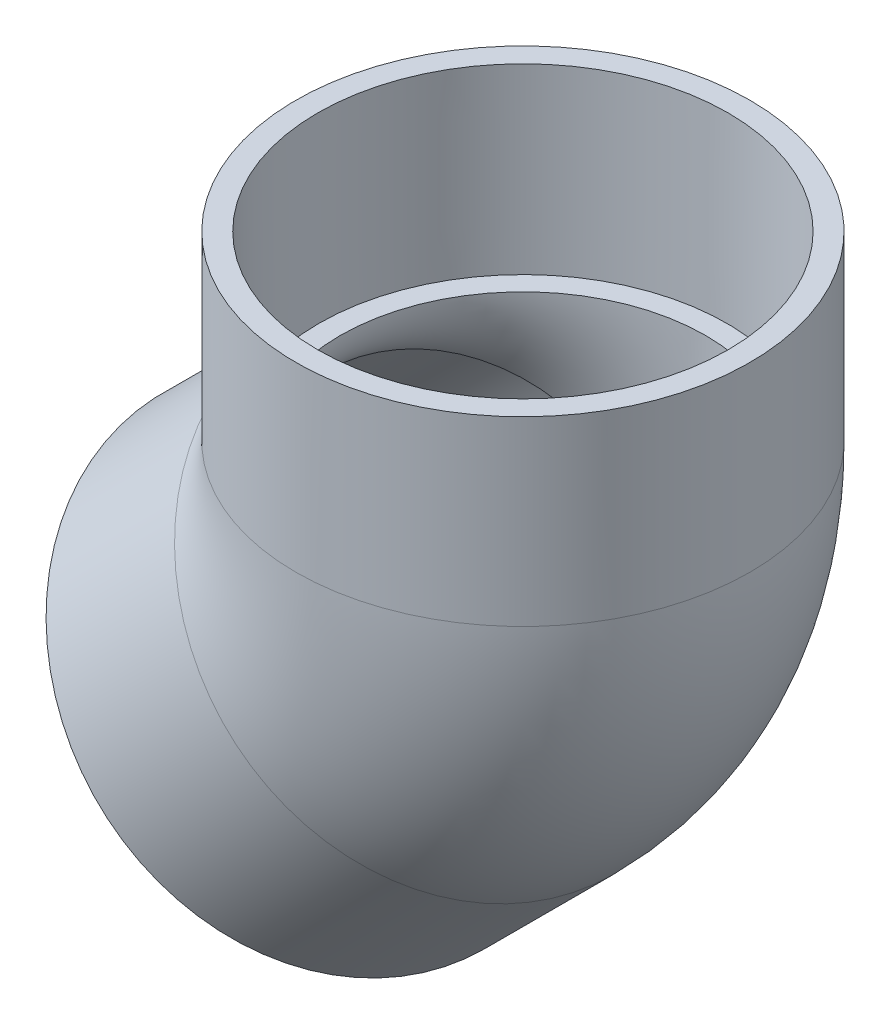
ISO-10303-21;
HEADER;
FILE_DESCRIPTION(('STEP AP214'),'2;1');
FILE_NAME('part.step','',(''),(''),'','','');
FILE_SCHEMA(('AUTOMOTIVE_DESIGN { 1 0 10303 214 1 1 1 1 }'));
ENDSEC;
DATA;
#1=APPLICATION_CONTEXT('core data for automotive mechanical design processes');
#2=APPLICATION_PROTOCOL_DEFINITION('international standard','automotive_design',2000,#1);
#3=PRODUCT_CONTEXT('',#1,'mechanical');
#4=PRODUCT('Part','Part','',(#3));
#5=PRODUCT_RELATED_PRODUCT_CATEGORY('part','',(#4));
#6=PRODUCT_DEFINITION_FORMATION('','',#4);
#7=PRODUCT_DEFINITION_CONTEXT('part definition',#1,'design');
#8=PRODUCT_DEFINITION('design','',#6,#7);
#9=PRODUCT_DEFINITION_SHAPE('','',#8);
#10=(LENGTH_UNIT() NAMED_UNIT(*) SI_UNIT(.MILLI.,.METRE.));
#11=(NAMED_UNIT(*) PLANE_ANGLE_UNIT() SI_UNIT($,.RADIAN.));
#12=(NAMED_UNIT(*) SI_UNIT($,.STERADIAN.) SOLID_ANGLE_UNIT());
#13=UNCERTAINTY_MEASURE_WITH_UNIT(LENGTH_MEASURE(1.E-05),#10,'distance_accuracy_value','');
#14=(GEOMETRIC_REPRESENTATION_CONTEXT(3) GLOBAL_UNCERTAINTY_ASSIGNED_CONTEXT((#13)) GLOBAL_UNIT_ASSIGNED_CONTEXT((#10,
#11,#12)) REPRESENTATION_CONTEXT('',''));
#15=CARTESIAN_POINT('',(0.,0.,0.));
#16=DIRECTION('',(0.,0.,1.));
#17=DIRECTION('',(1.,0.,0.));
#18=AXIS2_PLACEMENT_3D('',#15,#16,#17);
#19=CARTESIAN_POINT('',(-10.6640541437698,-100.466615354461,0.));
#20=DIRECTION('',(-0.707106781186549,-0.707106781186546,0.));
#21=DIRECTION('',(0.707106781186546,-0.707106781186549,0.));
#22=AXIS2_PLACEMENT_3D('',#19,#20,#21);
#23=PLANE('',#22);
#24=CARTESIAN_POINT('',(-55.5653347491155,-55.5653347491153,0.));
#25=DIRECTION('',(-0.707106781186549,-0.707106781186546,0.));
#26=DIRECTION('',(0.707106781186546,-0.707106781186549,0.));
#27=AXIS2_PLACEMENT_3D('',#24,#25,#26);
#28=CIRCLE('',#27,63.5);
#29=CARTESIAN_POINT('',(-10.6640541437698,-100.466615354461,0.));
#30=VERTEX_POINT('',#29);
#31=EDGE_CURVE('E49',#30,#30,#28,.T.);
#32=ORIENTED_EDGE('',*,*,#31,.T.);
#33=EDGE_LOOP('',(#32));
#34=FACE_BOUND('',#33,.T.);
#35=CARTESIAN_POINT('',(-55.5653347491155,-55.5653347491153,0.));
#36=DIRECTION('',(-0.707106781186549,-0.707106781186546,0.));
#37=DIRECTION('',(0.707106781186546,-0.707106781186549,0.));
#38=AXIS2_PLACEMENT_3D('',#35,#36,#37);
#39=CIRCLE('',#38,57.3786);
#40=CARTESIAN_POINT('',(-14.9925375941251,-96.1381319041058,0.));
#41=VERTEX_POINT('',#40);
#42=EDGE_CURVE('E36',#41,#41,#39,.T.);
#43=ORIENTED_EDGE('',*,*,#42,.F.);
#44=EDGE_LOOP('',(#43));
#45=FACE_BOUND('',#44,.T.);
#46=ADVANCED_FACE('F30',(#34,#45),#23,.T.);
#47=CARTESIAN_POINT('',(-19.6443102648388,-19.6443102648387,0.));
#48=DIRECTION('',(-0.707106781186549,-0.707106781186546,0.));
#49=DIRECTION('',(0.707106781186546,-0.707106781186549,0.));
#50=AXIS2_PLACEMENT_3D('',#47,#48,#49);
#51=CONICAL_SURFACE('',#50,57.0357,0.00674989748717757);
#52=ORIENTED_EDGE('',*,*,#42,.T.);
#53=EDGE_LOOP('',(#52));
#54=FACE_BOUND('',#53,.T.);
#55=CARTESIAN_POINT('',(-19.6443102648388,-19.6443102648387,0.));
#56=DIRECTION('',(-0.707106781186549,-0.707106781186546,0.));
#57=DIRECTION('',(0.707106781186546,-0.707106781186549,0.));
#58=AXIS2_PLACEMENT_3D('',#55,#56,#57);
#59=CIRCLE('',#58,57.0357);
#60=CARTESIAN_POINT('',(20.6860199748827,-59.9746405045604,0.));
#61=VERTEX_POINT('',#60);
#62=EDGE_CURVE('E40',#61,#61,#59,.T.);
#63=ORIENTED_EDGE('',*,*,#62,.F.);
#64=EDGE_LOOP('',(#63));
#65=FACE_BOUND('',#64,.T.);
#66=ADVANCED_FACE('F81',(#54,#65),#51,.F.);
#67=CARTESIAN_POINT('',(-55.5653347491155,-55.5653347491153,0.));
#68=DIRECTION('',(-0.707106781186549,-0.707106781186546,0.));
#69=DIRECTION('',(0.707106781186546,-0.707106781186549,0.));
#70=AXIS2_PLACEMENT_3D('',#67,#68,#69);
#71=CYLINDRICAL_SURFACE('',#70,63.5);
#72=CARTESIAN_POINT('',(-19.6443102648388,-19.6443102648388,0.));
#73=DIRECTION('',(-0.707106781186549,-0.707106781186546,0.));
#74=DIRECTION('',(0.707106781186546,-0.707106781186549,0.));
#75=AXIS2_PLACEMENT_3D('',#72,#73,#74);
#76=CIRCLE('',#75,63.5);
#77=CARTESIAN_POINT('',(25.2569703405069,-64.5455908701846,0.));
#78=VERTEX_POINT('',#77);
#79=EDGE_CURVE('E44',#78,#78,#76,.T.);
#80=ORIENTED_EDGE('',*,*,#79,.T.);
#81=EDGE_LOOP('',(#80));
#82=FACE_BOUND('',#81,.T.);
#83=ORIENTED_EDGE('',*,*,#31,.F.);
#84=EDGE_LOOP('',(#83));
#85=FACE_BOUND('',#84,.T.);
#86=ADVANCED_FACE('F86',(#82,#85),#71,.T.);
#87=CARTESIAN_POINT('',(-67.0698705296774,27.78125,0.));
#88=DIRECTION('',(0.,0.,-1.));
#89=DIRECTION('',(-1.,0.,0.));
#90=AXIS2_PLACEMENT_3D('',#87,#88,#89);
#91=TOROIDAL_SURFACE('',#90,67.0698705296774,51.1302);
#92=CARTESIAN_POINT('',(0.,27.78125,0.));
#93=DIRECTION('',(0.,1.,0.));
#94=DIRECTION('',(-1.,0.,0.));
#95=AXIS2_PLACEMENT_3D('',#92,#93,#94);
#96=CIRCLE('',#95,51.1302);
#97=CARTESIAN_POINT('',(51.1302,27.78125,0.));
#98=VERTEX_POINT('',#97);
#99=EDGE_CURVE('E55',#98,#98,#96,.T.);
#100=CARTESIAN_POINT('',(-19.6443102648388,-19.6443102648388,0.));
#101=DIRECTION('',(0.707106781186549,0.707106781186546,0.));
#102=DIRECTION('',(-0.707106781186546,0.707106781186549,0.));
#103=AXIS2_PLACEMENT_3D('',#100,#101,#102);
#104=CIRCLE('',#103,51.1302);
#105=CARTESIAN_POINT('',(16.5102008785855,-55.7988214082632,0.));
#106=VERTEX_POINT('',#105);
#107=EDGE_CURVE('E58',#106,#106,#104,.T.);
#108=CARTESIAN_POINT('',(-67.0698705296774,27.78125,0.));
#109=DIRECTION('',(0.,0.,-1.));
#110=DIRECTION('',(-1.,0.,0.));
#111=AXIS2_PLACEMENT_3D('',#108,#109,#110);
#112=CIRCLE('',#111,118.200070529677);
#113=EDGE_CURVE('',#98,#106,#112,.T.);
#114=ORIENTED_EDGE('',*,*,#99,.T.);
#115=ORIENTED_EDGE('',*,*,#107,.F.);
#116=ORIENTED_EDGE('',*,*,#113,.T.);
#117=ORIENTED_EDGE('',*,*,#113,.F.);
#118=EDGE_LOOP('',(#114,#116,#115,#117));
#119=FACE_BOUND('',#118,.T.);
#120=ADVANCED_FACE('F91',(#119),#91,.F.);
#121=CARTESIAN_POINT('',(-67.0698705296774,27.78125,0.));
#122=DIRECTION('',(0.,0.,-1.));
#123=DIRECTION('',(-1.,0.,0.));
#124=AXIS2_PLACEMENT_3D('',#121,#122,#123);
#125=TOROIDAL_SURFACE('',#124,67.0698705296774,63.5);
#126=CARTESIAN_POINT('',(0.,27.78125,0.));
#127=DIRECTION('',(0.,1.,0.));
#128=DIRECTION('',(-1.,0.,0.));
#129=AXIS2_PLACEMENT_3D('',#126,#127,#128);
#130=CIRCLE('',#129,63.5);
#131=CARTESIAN_POINT('',(63.5,27.78125,0.));
#132=VERTEX_POINT('',#131);
#133=EDGE_CURVE('E52',#132,#132,#130,.T.);
#134=CARTESIAN_POINT('',(-67.0698705296774,27.78125,0.));
#135=DIRECTION('',(0.,0.,-1.));
#136=DIRECTION('',(-1.,0.,0.));
#137=AXIS2_PLACEMENT_3D('',#134,#135,#136);
#138=CIRCLE('',#137,130.569870529677);
#139=EDGE_CURVE('',#132,#78,#138,.T.);
#140=ORIENTED_EDGE('',*,*,#133,.F.);
#141=ORIENTED_EDGE('',*,*,#79,.F.);
#142=ORIENTED_EDGE('',*,*,#139,.T.);
#143=ORIENTED_EDGE('',*,*,#139,.F.);
#144=EDGE_LOOP('',(#140,#142,#141,#143));
#145=FACE_BOUND('',#144,.T.);
#146=ADVANCED_FACE('F97',(#145),#125,.T.);
#147=CARTESIAN_POINT('',(0.,27.78125,0.));
#148=DIRECTION('',(0.,1.,0.));
#149=DIRECTION('',(-1.,0.,0.));
#150=AXIS2_PLACEMENT_3D('',#147,#148,#149);
#151=PLANE('',#150);
#152=CARTESIAN_POINT('',(0.,27.78125,0.));
#153=DIRECTION('',(0.,1.,0.));
#154=DIRECTION('',(-1.,0.,0.));
#155=AXIS2_PLACEMENT_3D('',#152,#153,#154);
#156=CIRCLE('',#155,57.0357);
#157=CARTESIAN_POINT('',(-57.0357,27.78125,0.));
#158=VERTEX_POINT('',#157);
#159=EDGE_CURVE('E10',#158,#158,#156,.F.);
#160=ORIENTED_EDGE('',*,*,#159,.F.);
#161=EDGE_LOOP('',(#160));
#162=FACE_BOUND('',#161,.T.);
#163=ORIENTED_EDGE('',*,*,#99,.F.);
#164=EDGE_LOOP('',(#163));
#165=FACE_BOUND('',#164,.T.);
#166=ADVANCED_FACE('F102',(#162,#165),#151,.T.);
#167=CARTESIAN_POINT('',(-19.6443102648388,-19.6443102648388,0.));
#168=DIRECTION('',(0.707106781186549,0.707106781186546,0.));
#169=DIRECTION('',(-0.707106781186546,0.707106781186549,0.));
#170=AXIS2_PLACEMENT_3D('',#167,#168,#169);
#171=PLANE('',#170);
#172=ORIENTED_EDGE('',*,*,#62,.T.);
#173=EDGE_LOOP('',(#172));
#174=FACE_BOUND('',#173,.T.);
#175=ORIENTED_EDGE('',*,*,#107,.T.);
#176=EDGE_LOOP('',(#175));
#177=FACE_BOUND('',#176,.T.);
#178=ADVANCED_FACE('F107',(#174,#177),#171,.F.);
#179=CARTESIAN_POINT('',(63.5,78.58125,0.));
#180=DIRECTION('',(0.,1.,0.));
#181=DIRECTION('',(0.,0.,1.));
#182=AXIS2_PLACEMENT_3D('',#179,#180,#181);
#183=PLANE('',#182);
#184=CARTESIAN_POINT('',(0.,78.58125,0.));
#185=DIRECTION('',(0.,-1.,0.));
#186=DIRECTION('',(0.,0.,-1.));
#187=AXIS2_PLACEMENT_3D('',#184,#185,#186);
#188=CIRCLE('',#187,57.3786);
#189=CARTESIAN_POINT('',(0.,78.58125,-57.3786));
#190=VERTEX_POINT('',#189);
#191=EDGE_CURVE('E64',#190,#190,#188,.T.);
#192=ORIENTED_EDGE('',*,*,#191,.T.);
#193=EDGE_LOOP('',(#192));
#194=FACE_BOUND('',#193,.T.);
#195=CARTESIAN_POINT('',(0.,78.58125,0.));
#196=DIRECTION('',(0.,-1.,0.));
#197=DIRECTION('',(0.,0.,-1.));
#198=AXIS2_PLACEMENT_3D('',#195,#196,#197);
#199=CIRCLE('',#198,63.5);
#200=CARTESIAN_POINT('',(0.,78.58125,-63.5));
#201=VERTEX_POINT('',#200);
#202=EDGE_CURVE('E61',#201,#201,#199,.T.);
#203=ORIENTED_EDGE('',*,*,#202,.F.);
#204=EDGE_LOOP('',(#203));
#205=FACE_BOUND('',#204,.T.);
#206=ADVANCED_FACE('F68',(#194,#205),#183,.T.);
#207=CARTESIAN_POINT('',(0.,0.,0.));
#208=DIRECTION('',(0.,-1.,0.));
#209=DIRECTION('',(0.,0.,-1.));
#210=AXIS2_PLACEMENT_3D('',#207,#208,#209);
#211=CYLINDRICAL_SURFACE('',#210,63.5);
#212=ORIENTED_EDGE('',*,*,#202,.T.);
#213=EDGE_LOOP('',(#212));
#214=FACE_BOUND('',#213,.T.);
#215=ORIENTED_EDGE('',*,*,#133,.T.);
#216=EDGE_LOOP('',(#215));
#217=FACE_BOUND('',#216,.T.);
#218=ADVANCED_FACE('F73',(#214,#217),#211,.T.);
#219=CARTESIAN_POINT('',(0.,78.58125,0.));
#220=DIRECTION('',(0.,1.,0.));
#221=DIRECTION('',(0.,0.,1.));
#222=AXIS2_PLACEMENT_3D('',#219,#220,#221);
#223=CONICAL_SURFACE('',#222,57.3786,0.00674989748717757);
#224=ORIENTED_EDGE('',*,*,#159,.T.);
#225=EDGE_LOOP('',(#224));
#226=FACE_BOUND('',#225,.T.);
#227=ORIENTED_EDGE('',*,*,#191,.F.);
#228=EDGE_LOOP('',(#227));
#229=FACE_BOUND('',#228,.T.);
#230=ADVANCED_FACE('F71',(#226,#229),#223,.F.);
#231=CLOSED_SHELL('',(#46,#66,#86,#120,#146,#166,#178,#206,#218,#230));
#232=MANIFOLD_SOLID_BREP('B2',#231);
#233=ADVANCED_BREP_SHAPE_REPRESENTATION('',(#18,#232),#14);
#234=SHAPE_DEFINITION_REPRESENTATION(#9,#233);
ENDSEC;
END-ISO-10303-21;
